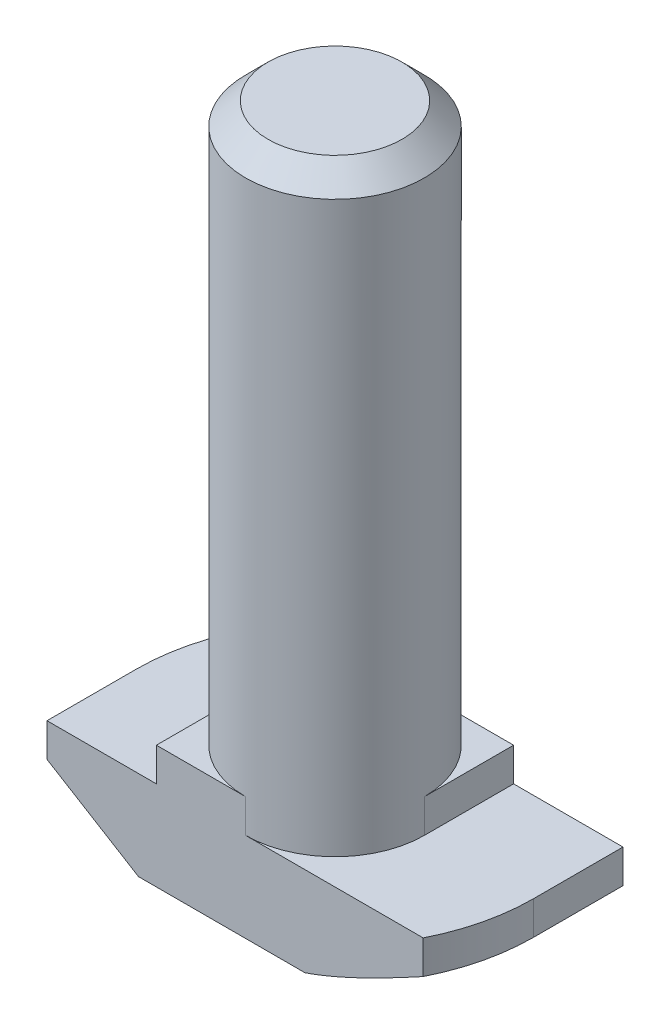
ISO-10303-21;
HEADER;
FILE_DESCRIPTION(('STEP AP214'),'2;1');
FILE_NAME('part.step','',(''),(''),'','','');
FILE_SCHEMA(('AUTOMOTIVE_DESIGN { 1 0 10303 214 1 1 1 1 }'));
ENDSEC;
DATA;
#1=APPLICATION_CONTEXT('core data for automotive mechanical design processes');
#2=APPLICATION_PROTOCOL_DEFINITION('international standard','automotive_design',2000,#1);
#3=PRODUCT_CONTEXT('',#1,'mechanical');
#4=PRODUCT('Part','Part','',(#3));
#5=PRODUCT_RELATED_PRODUCT_CATEGORY('part','',(#4));
#6=PRODUCT_DEFINITION_FORMATION('','',#4);
#7=PRODUCT_DEFINITION_CONTEXT('part definition',#1,'design');
#8=PRODUCT_DEFINITION('design','',#6,#7);
#9=PRODUCT_DEFINITION_SHAPE('','',#8);
#10=(LENGTH_UNIT() NAMED_UNIT(*) SI_UNIT(.MILLI.,.METRE.));
#11=(NAMED_UNIT(*) PLANE_ANGLE_UNIT() SI_UNIT($,.RADIAN.));
#12=(NAMED_UNIT(*) SI_UNIT($,.STERADIAN.) SOLID_ANGLE_UNIT());
#13=UNCERTAINTY_MEASURE_WITH_UNIT(LENGTH_MEASURE(1.E-05),#10,'distance_accuracy_value','');
#14=(GEOMETRIC_REPRESENTATION_CONTEXT(3) GLOBAL_UNCERTAINTY_ASSIGNED_CONTEXT((#13)) GLOBAL_UNIT_ASSIGNED_CONTEXT((#10,
#11,#12)) REPRESENTATION_CONTEXT('',''));
#15=CARTESIAN_POINT('',(0.,0.,0.));
#16=DIRECTION('',(0.,0.,1.));
#17=DIRECTION('',(1.,0.,0.));
#18=AXIS2_PLACEMENT_3D('',#15,#16,#17);
#19=CARTESIAN_POINT('',(-8.9,0.,4.));
#20=DIRECTION('',(1.,0.,0.));
#21=DIRECTION('',(0.,0.,-1.));
#22=AXIS2_PLACEMENT_3D('',#19,#20,#21);
#23=PLANE('',#22);
#24=DIRECTION('',(0.,0.,-1.));
#25=VECTOR('',#24,1.);
#26=CARTESIAN_POINT('',(-8.9,2.5,4.));
#27=LINE('',#26,#25);
#28=CARTESIAN_POINT('',(-8.9,2.5,4.));
#29=VERTEX_POINT('',#28);
#30=CARTESIAN_POINT('',(-8.9,2.5,0.));
#31=VERTEX_POINT('',#30);
#32=EDGE_CURVE('E369',#29,#31,#27,.T.);
#33=ORIENTED_EDGE('',*,*,#32,.F.);
#34=DIRECTION('',(0.,-1.,0.));
#35=VECTOR('',#34,1.);
#36=CARTESIAN_POINT('',(-8.9,0.,4.));
#37=LINE('',#36,#35);
#38=CARTESIAN_POINT('',(-8.9,4.,4.));
#39=VERTEX_POINT('',#38);
#40=EDGE_CURVE('E209',#39,#29,#37,.T.);
#41=ORIENTED_EDGE('',*,*,#40,.F.);
#42=DIRECTION('',(0.,0.,-1.));
#43=VECTOR('',#42,1.);
#44=CARTESIAN_POINT('',(-8.9,4.,4.));
#45=LINE('',#44,#43);
#46=CARTESIAN_POINT('',(-8.9,4.,0.));
#47=VERTEX_POINT('',#46);
#48=EDGE_CURVE('E224',#39,#47,#45,.T.);
#49=ORIENTED_EDGE('',*,*,#48,.T.);
#50=DIRECTION('',(0.,1.,0.));
#51=VECTOR('',#50,1.);
#52=CARTESIAN_POINT('',(-8.9,0.,0.));
#53=LINE('',#52,#51);
#54=EDGE_CURVE('E197',#31,#47,#53,.T.);
#55=ORIENTED_EDGE('',*,*,#54,.F.);
#56=EDGE_LOOP('',(#33,#41,#49,#55));
#57=FACE_BOUND('',#56,.T.);
#58=ADVANCED_FACE('F39',(#57),#23,.F.);
#59=CARTESIAN_POINT('',(8.9,0.,4.));
#60=DIRECTION('',(0.,1.,0.));
#61=DIRECTION('',(0.,0.,1.));
#62=AXIS2_PLACEMENT_3D('',#59,#60,#61);
#63=PLANE('',#62);
#64=DIRECTION('',(1.,0.,0.));
#65=VECTOR('',#64,1.);
#66=CARTESIAN_POINT('',(8.9,0.,4.));
#67=LINE('',#66,#65);
#68=CARTESIAN_POINT('',(-4.8,0.,4.));
#69=VERTEX_POINT('',#68);
#70=CARTESIAN_POINT('',(2.65329983228432,0.,4.));
#71=VERTEX_POINT('',#70);
#72=EDGE_CURVE('E212',#69,#71,#67,.T.);
#73=ORIENTED_EDGE('',*,*,#72,.F.);
#74=DIRECTION('',(0.,0.,-1.));
#75=VECTOR('',#74,1.);
#76=CARTESIAN_POINT('',(-4.8,0.,4.));
#77=LINE('',#76,#75);
#78=CARTESIAN_POINT('',(-4.8,0.,0.));
#79=VERTEX_POINT('',#78);
#80=EDGE_CURVE('E367',#69,#79,#77,.T.);
#81=ORIENTED_EDGE('',*,*,#80,.T.);
#82=CARTESIAN_POINT('',(0.,0.,0.));
#83=DIRECTION('',(0.,-1.,0.));
#84=DIRECTION('',(-1.,0.,0.));
#85=AXIS2_PLACEMENT_3D('',#82,#83,#84);
#86=CIRCLE('',#85,4.8);
#87=CARTESIAN_POINT('',(-2.65329983228432,0.,-4.));
#88=VERTEX_POINT('',#87);
#89=EDGE_CURVE('E366',#79,#88,#86,.T.);
#90=ORIENTED_EDGE('',*,*,#89,.T.);
#91=DIRECTION('',(1.,0.,0.));
#92=VECTOR('',#91,1.);
#93=CARTESIAN_POINT('',(8.9,0.,-4.));
#94=LINE('',#93,#92);
#95=CARTESIAN_POINT('',(4.8,0.,-4.));
#96=VERTEX_POINT('',#95);
#97=EDGE_CURVE('E208',#88,#96,#94,.T.);
#98=ORIENTED_EDGE('',*,*,#97,.T.);
#99=DIRECTION('',(0.,0.,1.));
#100=VECTOR('',#99,1.);
#101=CARTESIAN_POINT('',(4.8,0.,-8.9));
#102=LINE('',#101,#100);
#103=CARTESIAN_POINT('',(4.8,0.,0.));
#104=VERTEX_POINT('',#103);
#105=EDGE_CURVE('E55',#96,#104,#102,.T.);
#106=ORIENTED_EDGE('',*,*,#105,.T.);
#107=CARTESIAN_POINT('',(0.,0.,0.));
#108=DIRECTION('',(0.,-1.,0.));
#109=DIRECTION('',(1.,0.,0.));
#110=AXIS2_PLACEMENT_3D('',#107,#108,#109);
#111=CIRCLE('',#110,4.8);
#112=EDGE_CURVE('E155',#104,#71,#111,.T.);
#113=ORIENTED_EDGE('',*,*,#112,.T.);
#114=EDGE_LOOP('',(#73,#81,#90,#98,#106,#113));
#115=FACE_BOUND('',#114,.T.);
#116=ADVANCED_FACE('F270',(#115),#63,.F.);
#117=CARTESIAN_POINT('',(8.9,0.,4.));
#118=DIRECTION('',(-1.,0.,0.));
#119=DIRECTION('',(0.,0.,1.));
#120=AXIS2_PLACEMENT_3D('',#117,#118,#119);
#121=PLANE('',#120);
#122=DIRECTION('',(0.,0.,1.));
#123=VECTOR('',#122,1.);
#124=CARTESIAN_POINT('',(8.9,2.5,-8.9));
#125=LINE('',#124,#123);
#126=CARTESIAN_POINT('',(8.9,2.5,-4.));
#127=VERTEX_POINT('',#126);
#128=CARTESIAN_POINT('',(8.9,2.5,0.));
#129=VERTEX_POINT('',#128);
#130=EDGE_CURVE('E147',#127,#129,#125,.T.);
#131=ORIENTED_EDGE('',*,*,#130,.F.);
#132=DIRECTION('',(0.,1.,0.));
#133=VECTOR('',#132,1.);
#134=CARTESIAN_POINT('',(8.9,0.,-4.));
#135=LINE('',#134,#133);
#136=CARTESIAN_POINT('',(8.9,4.,-4.));
#137=VERTEX_POINT('',#136);
#138=EDGE_CURVE('E227',#127,#137,#135,.T.);
#139=ORIENTED_EDGE('',*,*,#138,.T.);
#140=DIRECTION('',(0.,0.,-1.));
#141=VECTOR('',#140,1.);
#142=CARTESIAN_POINT('',(8.9,4.,4.));
#143=LINE('',#142,#141);
#144=CARTESIAN_POINT('',(8.9,4.,0.));
#145=VERTEX_POINT('',#144);
#146=EDGE_CURVE('E175',#145,#137,#143,.T.);
#147=ORIENTED_EDGE('',*,*,#146,.F.);
#148=DIRECTION('',(0.,1.,0.));
#149=VECTOR('',#148,1.);
#150=CARTESIAN_POINT('',(8.9,0.,0.));
#151=LINE('',#150,#149);
#152=EDGE_CURVE('E168',#129,#145,#151,.T.);
#153=ORIENTED_EDGE('',*,*,#152,.F.);
#154=EDGE_LOOP('',(#131,#139,#147,#153));
#155=FACE_BOUND('',#154,.T.);
#156=ADVANCED_FACE('F173',(#155),#121,.F.);
#157=CARTESIAN_POINT('',(0.,0.,4.));
#158=DIRECTION('',(0.,0.,-1.));
#159=DIRECTION('',(-1.,0.,0.));
#160=AXIS2_PLACEMENT_3D('',#157,#158,#159);
#161=PLANE('',#160);
#162=DIRECTION('',(-0.853796175794036,0.520607424264656,0.));
#163=VECTOR('',#162,1.);
#164=CARTESIAN_POINT('',(-8.9,2.5,4.));
#165=LINE('',#164,#163);
#166=EDGE_CURVE('E375',#69,#29,#165,.T.);
#167=ORIENTED_EDGE('',*,*,#166,.F.);
#168=ORIENTED_EDGE('',*,*,#72,.T.);
#169=CARTESIAN_POINT('',(7.95117168412038,2.5003812948523,4.));
#170=CARTESIAN_POINT('',(7.73552594180779,2.38294262104349,4.));
#171=CARTESIAN_POINT('',(7.51949196287052,2.26620761305275,4.));
#172=CARTESIAN_POINT('',(7.08640702943254,2.03458295404349,4.));
#173=CARTESIAN_POINT('',(6.86935596494317,1.91969350884632,4.));
#174=CARTESIAN_POINT('',(6.43326841812792,1.6918189237928,4.));
#175=CARTESIAN_POINT('',(6.21422761700308,1.57884202880893,4.));
#176=CARTESIAN_POINT('',(5.77463734455681,1.3558784061402,4.));
#177=CARTESIAN_POINT('',(5.55408794028136,1.24589154663778,4.));
#178=CARTESIAN_POINT('',(5.11647910281973,1.03243373636638,4.));
#179=CARTESIAN_POINT('',(4.89946541196746,0.92886934419743,4.));
#180=CARTESIAN_POINT('',(4.46314517755054,0.726599943828819,4.));
#181=CARTESIAN_POINT('',(4.24383839666258,0.627895444761259,4.));
#182=CARTESIAN_POINT('',(3.80261128872497,0.437105119516572,4.));
#183=CARTESIAN_POINT('',(3.5806938708347,0.345012613183118,4.));
#184=CARTESIAN_POINT('',(3.13341004119999,0.169681531704238,4.));
#185=CARTESIAN_POINT('',(2.90804453781551,0.0864406691133928,4.));
#186=CARTESIAN_POINT('',(2.46564049107812,-0.0637337384147157,4.));
#187=CARTESIAN_POINT('',(2.24882314531661,-0.131311270143758,4.));
#188=CARTESIAN_POINT('',(1.81134539093152,-0.252017085141675,4.));
#189=CARTESIAN_POINT('',(1.59068966949939,-0.305161832872051,4.));
#190=CARTESIAN_POINT('',(1.25578974895032,-0.37125386899099,4.));
#191=CARTESIAN_POINT('',(1.1428915032614,-0.391082257285261,4.));
#192=CARTESIAN_POINT('',(0.916303642162891,-0.425522742673794,4.));
#193=CARTESIAN_POINT('',(0.802614110911478,-0.440135386106777,4.));
#194=CARTESIAN_POINT('',(0.574171741878051,-0.463762938801405,4.));
#195=CARTESIAN_POINT('',(0.459416448807066,-0.472754337723224,4.));
#196=CARTESIAN_POINT('',(0.229544837125645,-0.484799371089924,4.));
#197=CARTESIAN_POINT('',(0.11442837922421,-0.487850330163754,4.));
#198=CARTESIAN_POINT('',(-0.000700000000000364,-0.487804840701222,4.));
#199=B_SPLINE_CURVE_WITH_KNOTS('',3,(#169,#170,#171,#172,#173,#174,#175,#176,#177,#178,#179,
#180,#181,#182,#183,#184,#185,#186,#187,#188,#189,#190,#191,#192,#193,#194,#195,#196,#197,#198),
.UNSPECIFIED.,.F.,.F.,(4,2,2,2,2,2,2,2,2,2,2,2,2,2,4),(0.,0.73665607857229,1.47339374819651,
2.212756769811,2.95208714311461,3.6734194697194,4.39482720444832,5.11549552795205,
5.83597716113291,6.51694414905028,7.19713101684283,7.54090798827143,7.88464893918285,
8.22981810256985,8.57514268242548),.UNSPECIFIED.);
#200=CARTESIAN_POINT('',(7.95047168412038,2.5,4.));
#201=VERTEX_POINT('',#200);
#202=EDGE_CURVE('E319',#201,#71,#199,.T.);
#203=ORIENTED_EDGE('',*,*,#202,.F.);
#204=DIRECTION('',(0.,1.,0.));
#205=VECTOR('',#204,1.);
#206=CARTESIAN_POINT('',(7.95047168412038,0.,4.));
#207=LINE('',#206,#205);
#208=CARTESIAN_POINT('',(7.95047168412038,4.,4.));
#209=VERTEX_POINT('',#208);
#210=EDGE_CURVE('E170',#201,#209,#207,.T.);
#211=ORIENTED_EDGE('',*,*,#210,.T.);
#212=DIRECTION('',(-1.,0.,0.));
#213=VECTOR('',#212,1.);
#214=CARTESIAN_POINT('',(8.9,4.,4.));
#215=LINE('',#214,#213);
#216=CARTESIAN_POINT('',(0.,4.,4.));
#217=VERTEX_POINT('',#216);
#218=EDGE_CURVE('E216',#209,#217,#215,.T.);
#219=ORIENTED_EDGE('',*,*,#218,.T.);
#220=DIRECTION('',(0.,1.,0.));
#221=VECTOR('',#220,1.);
#222=CARTESIAN_POINT('',(0.,-1.65685424949238,4.));
#223=LINE('',#222,#221);
#224=CARTESIAN_POINT('',(0.,5.5,4.));
#225=VERTEX_POINT('',#224);
#226=EDGE_CURVE('E193',#217,#225,#223,.T.);
#227=ORIENTED_EDGE('',*,*,#226,.T.);
#228=DIRECTION('',(-1.,0.,0.));
#229=VECTOR('',#228,1.);
#230=CARTESIAN_POINT('',(-4.,5.5,4.));
#231=LINE('',#230,#229);
#232=CARTESIAN_POINT('',(-4.,5.5,4.));
#233=VERTEX_POINT('',#232);
#234=EDGE_CURVE('E218',#225,#233,#231,.T.);
#235=ORIENTED_EDGE('',*,*,#234,.T.);
#236=DIRECTION('',(0.,-1.,0.));
#237=VECTOR('',#236,1.);
#238=CARTESIAN_POINT('',(-4.,4.,4.));
#239=LINE('',#238,#237);
#240=CARTESIAN_POINT('',(-4.,4.,4.));
#241=VERTEX_POINT('',#240);
#242=EDGE_CURVE('E220',#233,#241,#239,.T.);
#243=ORIENTED_EDGE('',*,*,#242,.T.);
#244=DIRECTION('',(-1.,0.,0.));
#245=VECTOR('',#244,1.);
#246=CARTESIAN_POINT('',(-8.9,4.,4.));
#247=LINE('',#246,#245);
#248=EDGE_CURVE('E222',#241,#39,#247,.T.);
#249=ORIENTED_EDGE('',*,*,#248,.T.);
#250=ORIENTED_EDGE('',*,*,#40,.T.);
#251=EDGE_LOOP('',(#167,#168,#203,#211,#219,#227,#235,#243,#249,#250));
#252=FACE_BOUND('',#251,.T.);
#253=ADVANCED_FACE('F281',(#252),#161,.F.);
#254=CARTESIAN_POINT('',(0.,0.,-4.));
#255=DIRECTION('',(0.,0.,-1.));
#256=DIRECTION('',(-1.,0.,0.));
#257=AXIS2_PLACEMENT_3D('',#254,#255,#256);
#258=PLANE('',#257);
#259=ORIENTED_EDGE('',*,*,#97,.F.);
#260=CARTESIAN_POINT('',(0.000700000000000375,-0.487804840701222,-4.));
#261=CARTESIAN_POINT('',(-0.0911783891396318,-0.48782848460975,-4.));
#262=CARTESIAN_POINT('',(-0.183052746172593,-0.485894534221646,-4.));
#263=CARTESIAN_POINT('',(-0.366624394777082,-0.478214110158694,-4.));
#264=CARTESIAN_POINT('',(-0.458321717815279,-0.472468391698149,-4.));
#265=CARTESIAN_POINT('',(-0.641197389589646,-0.457284413495929,-4.));
#266=CARTESIAN_POINT('',(-0.732376445680467,-0.447854631312074,-4.));
#267=CARTESIAN_POINT('',(-0.914302231773763,-0.425490539884402,-4.));
#268=CARTESIAN_POINT('',(-1.00504894282095,-0.41255607839799,-4.));
#269=CARTESIAN_POINT('',(-1.27475669839242,-0.369111241216707,-4.));
#270=CARTESIAN_POINT('',(-1.45295798960378,-0.333803642672856,-4.));
#271=CARTESIAN_POINT('',(-1.80688694554488,-0.252374259841994,-4.));
#272=CARTESIAN_POINT('',(-1.98261350049563,-0.206247777936689,-4.));
#273=CARTESIAN_POINT('',(-2.40843477616905,-0.0830176290147687,-4.));
#274=CARTESIAN_POINT('',(-2.65716286909735,-0.00122224492027907,-4.));
#275=CARTESIAN_POINT('',(-3.1500236667871,0.175317023068226,-4.));
#276=CARTESIAN_POINT('',(-3.39415374276215,0.270068072754652,-4.));
#277=CARTESIAN_POINT('',(-3.87928874246701,0.469058436828284,-4.));
#278=CARTESIAN_POINT('',(-4.12028285320838,0.573323871149427,-4.));
#279=CARTESIAN_POINT('',(-4.59919632282166,0.788504405818799,-4.));
#280=CARTESIAN_POINT('',(-4.83711633279242,0.899418069039211,-4.));
#281=CARTESIAN_POINT('',(-5.31822851183188,1.1297988974704,-4.));
#282=CARTESIAN_POINT('',(-5.56134348218909,1.24942652452964,-4.));
#283=CARTESIAN_POINT('',(-6.045636996258,1.49257282867588,-4.));
#284=CARTESIAN_POINT('',(-6.28681538137222,1.61609182045058,-4.));
#285=CARTESIAN_POINT('',(-6.76588702271679,1.86515627626158,-4.));
#286=CARTESIAN_POINT('',(-7.0037914098582,1.99068039524177,-4.));
#287=CARTESIAN_POINT('',(-7.47834127800901,2.24398618358021,-4.));
#288=CARTESIAN_POINT('',(-7.71498697875761,2.37176744085524,-4.));
#289=CARTESIAN_POINT('',(-7.95117168412038,2.50038129485229,-4.));
#290=B_SPLINE_CURVE_WITH_KNOTS('',3,(#260,#261,#262,#263,#264,#265,#266,#267,#268,#269,#270,
#271,#272,#273,#274,#275,#276,#277,#278,#279,#280,#281,#282,#283,#284,#285,#286,#287,#288,#289),
.UNSPECIFIED.,.F.,.F.,(4,2,2,2,2,2,2,2,2,2,2,2,2,2,4),(0.,0.275607667670162,0.551160746311937,
0.82608343769266,1.10101807357745,1.64556230190507,2.19034341346489,2.97528858833922,
3.76066968678114,4.54827578228531,5.33571223306797,6.14852584679743,6.96140536089395,
7.76835733370051,8.57516347444109),.UNSPECIFIED.);
#291=CARTESIAN_POINT('',(-7.95047168412038,2.5,-4.));
#292=VERTEX_POINT('',#291);
#293=EDGE_CURVE('E313',#88,#292,#290,.T.);
#294=ORIENTED_EDGE('',*,*,#293,.T.);
#295=DIRECTION('',(0.,1.,0.));
#296=VECTOR('',#295,1.);
#297=CARTESIAN_POINT('',(-7.95047168412038,0.,-4.));
#298=LINE('',#297,#296);
#299=CARTESIAN_POINT('',(-7.95047168412038,4.,-4.));
#300=VERTEX_POINT('',#299);
#301=EDGE_CURVE('E179',#292,#300,#298,.T.);
#302=ORIENTED_EDGE('',*,*,#301,.T.);
#303=DIRECTION('',(-1.,0.,0.));
#304=VECTOR('',#303,1.);
#305=CARTESIAN_POINT('',(-8.9,4.,-4.));
#306=LINE('',#305,#304);
#307=CARTESIAN_POINT('',(0.,4.,-4.));
#308=VERTEX_POINT('',#307);
#309=EDGE_CURVE('E213',#308,#300,#306,.T.);
#310=ORIENTED_EDGE('',*,*,#309,.F.);
#311=DIRECTION('',(0.,1.,0.));
#312=VECTOR('',#311,1.);
#313=CARTESIAN_POINT('',(0.,-1.65685424949238,-4.));
#314=LINE('',#313,#312);
#315=CARTESIAN_POINT('',(0.,5.5,-4.));
#316=VERTEX_POINT('',#315);
#317=EDGE_CURVE('E204',#308,#316,#314,.T.);
#318=ORIENTED_EDGE('',*,*,#317,.T.);
#319=DIRECTION('',(-1.,0.,0.));
#320=VECTOR('',#319,1.);
#321=CARTESIAN_POINT('',(-4.,5.5,-4.));
#322=LINE('',#321,#320);
#323=CARTESIAN_POINT('',(4.,5.5,-4.));
#324=VERTEX_POINT('',#323);
#325=EDGE_CURVE('E235',#324,#316,#322,.T.);
#326=ORIENTED_EDGE('',*,*,#325,.F.);
#327=DIRECTION('',(0.,1.,0.));
#328=VECTOR('',#327,1.);
#329=CARTESIAN_POINT('',(4.,4.,-4.));
#330=LINE('',#329,#328);
#331=CARTESIAN_POINT('',(4.,4.,-4.));
#332=VERTEX_POINT('',#331);
#333=EDGE_CURVE('E232',#332,#324,#330,.T.);
#334=ORIENTED_EDGE('',*,*,#333,.F.);
#335=DIRECTION('',(-1.,0.,0.));
#336=VECTOR('',#335,1.);
#337=CARTESIAN_POINT('',(8.9,4.,-4.));
#338=LINE('',#337,#336);
#339=EDGE_CURVE('E229',#137,#332,#338,.T.);
#340=ORIENTED_EDGE('',*,*,#339,.F.);
#341=ORIENTED_EDGE('',*,*,#138,.F.);
#342=DIRECTION('',(-0.853796175794036,-0.520607424264656,0.));
#343=VECTOR('',#342,1.);
#344=CARTESIAN_POINT('',(1.3009540329575,-2.13356461405031,-4.));
#345=LINE('',#344,#343);
#346=EDGE_CURVE('E151',#127,#96,#345,.T.);
#347=ORIENTED_EDGE('',*,*,#346,.T.);
#348=EDGE_LOOP('',(#259,#294,#302,#310,#318,#326,#334,#340,#341,#347));
#349=FACE_BOUND('',#348,.T.);
#350=ADVANCED_FACE('F304',(#349),#258,.T.);
#351=CARTESIAN_POINT('',(0.,0.,0.));
#352=DIRECTION('',(0.,1.,0.));
#353=DIRECTION('',(0.,0.,1.));
#354=AXIS2_PLACEMENT_3D('',#351,#352,#353);
#355=CYLINDRICAL_SURFACE('',#354,8.9);
#356=CARTESIAN_POINT('',(0.,2.5,0.));
#357=DIRECTION('',(0.,-1.,0.));
#358=DIRECTION('',(-1.,0.,0.));
#359=AXIS2_PLACEMENT_3D('',#356,#357,#358);
#360=CIRCLE('',#359,8.9);
#361=EDGE_CURVE('E63',#31,#292,#360,.T.);
#362=ORIENTED_EDGE('',*,*,#361,.F.);
#363=ORIENTED_EDGE('',*,*,#54,.T.);
#364=CARTESIAN_POINT('',(0.,4.,0.));
#365=DIRECTION('',(0.,-1.,0.));
#366=DIRECTION('',(0.,0.,-1.));
#367=AXIS2_PLACEMENT_3D('',#364,#365,#366);
#368=CIRCLE('',#367,8.9);
#369=EDGE_CURVE('E176',#47,#300,#368,.T.);
#370=ORIENTED_EDGE('',*,*,#369,.T.);
#371=ORIENTED_EDGE('',*,*,#301,.F.);
#372=EDGE_LOOP('',(#362,#363,#370,#371));
#373=FACE_BOUND('',#372,.T.);
#374=ADVANCED_FACE('F308',(#373),#355,.T.);
#375=CARTESIAN_POINT('',(0.,0.,0.));
#376=DIRECTION('',(0.,1.,0.));
#377=DIRECTION('',(0.,0.,1.));
#378=AXIS2_PLACEMENT_3D('',#375,#376,#377);
#379=CYLINDRICAL_SURFACE('',#378,8.9);
#380=CARTESIAN_POINT('',(0.,2.5,0.));
#381=DIRECTION('',(0.,-1.,0.));
#382=DIRECTION('',(1.,0.,0.));
#383=AXIS2_PLACEMENT_3D('',#380,#381,#382);
#384=CIRCLE('',#383,8.9);
#385=EDGE_CURVE('E160',#129,#201,#384,.T.);
#386=ORIENTED_EDGE('',*,*,#385,.F.);
#387=ORIENTED_EDGE('',*,*,#152,.T.);
#388=CARTESIAN_POINT('',(0.,4.,0.));
#389=DIRECTION('',(0.,-1.,0.));
#390=DIRECTION('',(0.,0.,-1.));
#391=AXIS2_PLACEMENT_3D('',#388,#389,#390);
#392=CIRCLE('',#391,8.9);
#393=EDGE_CURVE('E181',#145,#209,#392,.T.);
#394=ORIENTED_EDGE('',*,*,#393,.T.);
#395=ORIENTED_EDGE('',*,*,#210,.F.);
#396=EDGE_LOOP('',(#386,#387,#394,#395));
#397=FACE_BOUND('',#396,.T.);
#398=ADVANCED_FACE('F166',(#397),#379,.T.);
#399=CARTESIAN_POINT('',(-4.,5.5,4.));
#400=DIRECTION('',(0.,-1.,0.));
#401=DIRECTION('',(0.,0.,-1.));
#402=AXIS2_PLACEMENT_3D('',#399,#400,#401);
#403=PLANE('',#402);
#404=CARTESIAN_POINT('',(0.,5.5,0.));
#405=DIRECTION('',(0.,1.,0.));
#406=DIRECTION('',(0.,0.,1.));
#407=AXIS2_PLACEMENT_3D('',#404,#405,#406);
#408=CIRCLE('',#407,4.);
#409=CARTESIAN_POINT('',(4.,5.5,0.));
#410=VERTEX_POINT('',#409);
#411=EDGE_CURVE('E186',#410,#316,#408,.T.);
#412=ORIENTED_EDGE('',*,*,#411,.F.);
#413=DIRECTION('',(0.,0.,-1.));
#414=VECTOR('',#413,1.);
#415=CARTESIAN_POINT('',(4.,5.5,4.));
#416=LINE('',#415,#414);
#417=EDGE_CURVE('E248',#410,#324,#416,.T.);
#418=ORIENTED_EDGE('',*,*,#417,.T.);
#419=ORIENTED_EDGE('',*,*,#325,.T.);
#420=EDGE_LOOP('',(#412,#418,#419));
#421=FACE_BOUND('',#420,.T.);
#422=ADVANCED_FACE('F294',(#421),#403,.F.);
#423=CARTESIAN_POINT('',(-4.,5.5,0.));
#424=VERTEX_POINT('',#423);
#425=EDGE_CURVE('E189',#424,#225,#408,.T.);
#426=ORIENTED_EDGE('',*,*,#425,.F.);
#427=DIRECTION('',(0.,0.,-1.));
#428=VECTOR('',#427,1.);
#429=CARTESIAN_POINT('',(-4.,5.5,4.));
#430=LINE('',#429,#428);
#431=EDGE_CURVE('E245',#233,#424,#430,.T.);
#432=ORIENTED_EDGE('',*,*,#431,.F.);
#433=ORIENTED_EDGE('',*,*,#234,.F.);
#434=EDGE_LOOP('',(#426,#432,#433));
#435=FACE_BOUND('',#434,.T.);
#436=ADVANCED_FACE('F286',(#435),#403,.F.);
#437=CARTESIAN_POINT('',(8.9,4.,4.));
#438=DIRECTION('',(0.,-1.,0.));
#439=DIRECTION('',(0.,0.,-1.));
#440=AXIS2_PLACEMENT_3D('',#437,#438,#439);
#441=PLANE('',#440);
#442=ORIENTED_EDGE('',*,*,#218,.F.);
#443=ORIENTED_EDGE('',*,*,#393,.F.);
#444=ORIENTED_EDGE('',*,*,#146,.T.);
#445=ORIENTED_EDGE('',*,*,#339,.T.);
#446=DIRECTION('',(0.,0.,-1.));
#447=VECTOR('',#446,1.);
#448=CARTESIAN_POINT('',(4.,4.,4.));
#449=LINE('',#448,#447);
#450=CARTESIAN_POINT('',(4.,4.,0.));
#451=VERTEX_POINT('',#450);
#452=EDGE_CURVE('E250',#451,#332,#449,.T.);
#453=ORIENTED_EDGE('',*,*,#452,.F.);
#454=CARTESIAN_POINT('',(0.,4.,0.));
#455=DIRECTION('',(0.,-1.,0.));
#456=DIRECTION('',(0.,0.,-1.));
#457=AXIS2_PLACEMENT_3D('',#454,#455,#456);
#458=CIRCLE('',#457,4.);
#459=EDGE_CURVE('E190',#451,#217,#458,.T.);
#460=ORIENTED_EDGE('',*,*,#459,.T.);
#461=EDGE_LOOP('',(#442,#443,#444,#445,#453,#460));
#462=FACE_BOUND('',#461,.T.);
#463=ADVANCED_FACE('F282',(#462),#441,.F.);
#464=CARTESIAN_POINT('',(4.,4.,4.));
#465=DIRECTION('',(-1.,0.,0.));
#466=DIRECTION('',(0.,0.,1.));
#467=AXIS2_PLACEMENT_3D('',#464,#465,#466);
#468=PLANE('',#467);
#469=ORIENTED_EDGE('',*,*,#417,.F.);
#470=DIRECTION('',(0.,1.,0.));
#471=VECTOR('',#470,1.);
#472=CARTESIAN_POINT('',(4.,-1.65685424949238,0.));
#473=LINE('',#472,#471);
#474=EDGE_CURVE('E194',#451,#410,#473,.T.);
#475=ORIENTED_EDGE('',*,*,#474,.F.);
#476=ORIENTED_EDGE('',*,*,#452,.T.);
#477=ORIENTED_EDGE('',*,*,#333,.T.);
#478=EDGE_LOOP('',(#469,#475,#476,#477));
#479=FACE_BOUND('',#478,.T.);
#480=ADVANCED_FACE('F285',(#479),#468,.F.);
#481=CARTESIAN_POINT('',(-4.,4.,4.));
#482=DIRECTION('',(1.,0.,0.));
#483=DIRECTION('',(0.,0.,-1.));
#484=AXIS2_PLACEMENT_3D('',#481,#482,#483);
#485=PLANE('',#484);
#486=ORIENTED_EDGE('',*,*,#431,.T.);
#487=DIRECTION('',(0.,1.,0.));
#488=VECTOR('',#487,1.);
#489=CARTESIAN_POINT('',(-4.,-1.65685424949238,0.));
#490=LINE('',#489,#488);
#491=CARTESIAN_POINT('',(-4.,4.,0.));
#492=VERTEX_POINT('',#491);
#493=EDGE_CURVE('E200',#492,#424,#490,.T.);
#494=ORIENTED_EDGE('',*,*,#493,.F.);
#495=DIRECTION('',(0.,0.,-1.));
#496=VECTOR('',#495,1.);
#497=CARTESIAN_POINT('',(-4.,4.,4.));
#498=LINE('',#497,#496);
#499=EDGE_CURVE('E242',#241,#492,#498,.T.);
#500=ORIENTED_EDGE('',*,*,#499,.F.);
#501=ORIENTED_EDGE('',*,*,#242,.F.);
#502=EDGE_LOOP('',(#486,#494,#500,#501));
#503=FACE_BOUND('',#502,.T.);
#504=ADVANCED_FACE('F290',(#503),#485,.F.);
#505=CARTESIAN_POINT('',(-8.9,4.,4.));
#506=DIRECTION('',(0.,-1.,0.));
#507=DIRECTION('',(0.,0.,-1.));
#508=AXIS2_PLACEMENT_3D('',#505,#506,#507);
#509=PLANE('',#508);
#510=ORIENTED_EDGE('',*,*,#309,.T.);
#511=ORIENTED_EDGE('',*,*,#369,.F.);
#512=ORIENTED_EDGE('',*,*,#48,.F.);
#513=ORIENTED_EDGE('',*,*,#248,.F.);
#514=ORIENTED_EDGE('',*,*,#499,.T.);
#515=CARTESIAN_POINT('',(0.,4.,0.));
#516=DIRECTION('',(0.,-1.,0.));
#517=DIRECTION('',(0.,0.,-1.));
#518=AXIS2_PLACEMENT_3D('',#515,#516,#517);
#519=CIRCLE('',#518,4.);
#520=EDGE_CURVE('E201',#492,#308,#519,.T.);
#521=ORIENTED_EDGE('',*,*,#520,.T.);
#522=EDGE_LOOP('',(#510,#511,#512,#513,#514,#521));
#523=FACE_BOUND('',#522,.T.);
#524=ADVANCED_FACE('F298',(#523),#509,.F.);
#525=CARTESIAN_POINT('',(0.,-1.65685424949238,0.));
#526=DIRECTION('',(0.,1.,0.));
#527=DIRECTION('',(0.,0.,1.));
#528=AXIS2_PLACEMENT_3D('',#525,#526,#527);
#529=CYLINDRICAL_SURFACE('',#528,4.);
#530=CARTESIAN_POINT('',(0.,29.5,0.));
#531=DIRECTION('',(0.,1.,0.));
#532=DIRECTION('',(0.,0.,1.));
#533=AXIS2_PLACEMENT_3D('',#530,#531,#532);
#534=CIRCLE('',#533,4.);
#535=CARTESIAN_POINT('',(0.,29.5,4.));
#536=VERTEX_POINT('',#535);
#537=EDGE_CURVE('E11',#536,#536,#534,.F.);
#538=ORIENTED_EDGE('',*,*,#537,.T.);
#539=EDGE_LOOP('',(#538));
#540=FACE_BOUND('',#539,.T.);
#541=ORIENTED_EDGE('',*,*,#474,.T.);
#542=ORIENTED_EDGE('',*,*,#411,.T.);
#543=ORIENTED_EDGE('',*,*,#317,.F.);
#544=ORIENTED_EDGE('',*,*,#520,.F.);
#545=ORIENTED_EDGE('',*,*,#493,.T.);
#546=ORIENTED_EDGE('',*,*,#425,.T.);
#547=ORIENTED_EDGE('',*,*,#226,.F.);
#548=ORIENTED_EDGE('',*,*,#459,.F.);
#549=EDGE_LOOP('',(#541,#542,#543,#544,#545,#546,#547,#548));
#550=FACE_BOUND('',#549,.T.);
#551=ADVANCED_FACE('F302',(#540,#550),#529,.T.);
#552=CARTESIAN_POINT('',(0.,30.5,0.));
#553=DIRECTION('',(0.,1.,0.));
#554=DIRECTION('',(0.,0.,1.));
#555=AXIS2_PLACEMENT_3D('',#552,#553,#554);
#556=PLANE('',#555);
#557=CARTESIAN_POINT('',(0.,30.5,0.));
#558=DIRECTION('',(0.,1.,0.));
#559=DIRECTION('',(0.,0.,1.));
#560=AXIS2_PLACEMENT_3D('',#557,#558,#559);
#561=CIRCLE('',#560,3.);
#562=CARTESIAN_POINT('',(0.,30.5,3.));
#563=VERTEX_POINT('',#562);
#564=EDGE_CURVE('E48',#563,#563,#561,.T.);
#565=ORIENTED_EDGE('',*,*,#564,.T.);
#566=EDGE_LOOP('',(#565));
#567=FACE_BOUND('',#566,.T.);
#568=ADVANCED_FACE('F255',(#567),#556,.T.);
#569=CARTESIAN_POINT('',(8.9,2.5,-8.9));
#570=DIRECTION('',(0.520607424264656,-0.853796175794036,0.));
#571=DIRECTION('',(0.853796175794036,0.520607424264656,0.));
#572=AXIS2_PLACEMENT_3D('',#569,#570,#571);
#573=PLANE('',#572);
#574=ORIENTED_EDGE('',*,*,#130,.T.);
#575=DIRECTION('',(0.853796175794036,0.520607424264656,0.));
#576=VECTOR('',#575,1.);
#577=CARTESIAN_POINT('',(8.9,2.5,0.));
#578=LINE('',#577,#576);
#579=EDGE_CURVE('E150',#104,#129,#578,.T.);
#580=ORIENTED_EDGE('',*,*,#579,.F.);
#581=ORIENTED_EDGE('',*,*,#105,.F.);
#582=ORIENTED_EDGE('',*,*,#346,.F.);
#583=EDGE_LOOP('',(#574,#580,#581,#582));
#584=FACE_BOUND('',#583,.T.);
#585=ADVANCED_FACE('F149',(#584),#573,.T.);
#586=CARTESIAN_POINT('',(0.,0.,0.));
#587=DIRECTION('',(0.,1.,0.));
#588=DIRECTION('',(0.,0.,1.));
#589=AXIS2_PLACEMENT_3D('',#586,#587,#588);
#590=CONICAL_SURFACE('',#589,4.8,1.0232340908549);
#591=ORIENTED_EDGE('',*,*,#202,.T.);
#592=ORIENTED_EDGE('',*,*,#112,.F.);
#593=ORIENTED_EDGE('',*,*,#579,.T.);
#594=ORIENTED_EDGE('',*,*,#385,.T.);
#595=EDGE_LOOP('',(#591,#592,#593,#594));
#596=FACE_BOUND('',#595,.T.);
#597=ADVANCED_FACE('F159',(#596),#590,.T.);
#598=CARTESIAN_POINT('',(-8.9,2.5,4.));
#599=DIRECTION('',(-0.520607424264656,-0.853796175794036,0.));
#600=DIRECTION('',(0.853796175794036,-0.520607424264656,0.));
#601=AXIS2_PLACEMENT_3D('',#598,#599,#600);
#602=PLANE('',#601);
#603=ORIENTED_EDGE('',*,*,#32,.T.);
#604=DIRECTION('',(-0.853796175794036,0.520607424264656,0.));
#605=VECTOR('',#604,1.);
#606=CARTESIAN_POINT('',(-8.9,2.5,0.));
#607=LINE('',#606,#605);
#608=EDGE_CURVE('E372',#79,#31,#607,.T.);
#609=ORIENTED_EDGE('',*,*,#608,.F.);
#610=ORIENTED_EDGE('',*,*,#80,.F.);
#611=ORIENTED_EDGE('',*,*,#166,.T.);
#612=EDGE_LOOP('',(#603,#609,#610,#611));
#613=FACE_BOUND('',#612,.T.);
#614=ADVANCED_FACE('F260',(#613),#602,.T.);
#615=CARTESIAN_POINT('',(0.,0.,0.));
#616=DIRECTION('',(0.,1.,0.));
#617=DIRECTION('',(0.,0.,1.));
#618=AXIS2_PLACEMENT_3D('',#615,#616,#617);
#619=CONICAL_SURFACE('',#618,4.8,1.0232340908549);
#620=ORIENTED_EDGE('',*,*,#89,.F.);
#621=ORIENTED_EDGE('',*,*,#608,.T.);
#622=ORIENTED_EDGE('',*,*,#361,.T.);
#623=ORIENTED_EDGE('',*,*,#293,.F.);
#624=EDGE_LOOP('',(#620,#621,#622,#623));
#625=FACE_BOUND('',#624,.T.);
#626=ADVANCED_FACE('F258',(#625),#619,.T.);
#627=CARTESIAN_POINT('',(0.,30.5,0.));
#628=DIRECTION('',(0.,-1.,0.));
#629=DIRECTION('',(0.,0.,-1.));
#630=AXIS2_PLACEMENT_3D('',#627,#628,#629);
#631=CONICAL_SURFACE('',#630,3.,0.785398163397443);
#632=ORIENTED_EDGE('',*,*,#537,.F.);
#633=EDGE_LOOP('',(#632));
#634=FACE_BOUND('',#633,.T.);
#635=ORIENTED_EDGE('',*,*,#564,.F.);
#636=EDGE_LOOP('',(#635));
#637=FACE_BOUND('',#636,.T.);
#638=ADVANCED_FACE('F42',(#634,#637),#631,.T.);
#639=CLOSED_SHELL('',(#58,#116,#156,#253,#350,#374,#398,#422,#436,#463,#480,#504,#524,#551,#568,
#585,#597,#614,#626,#638));
#640=MANIFOLD_SOLID_BREP('B2',#639);
#641=ADVANCED_BREP_SHAPE_REPRESENTATION('',(#18,#640),#14);
#642=SHAPE_DEFINITION_REPRESENTATION(#9,#641);
ENDSEC;
END-ISO-10303-21;
